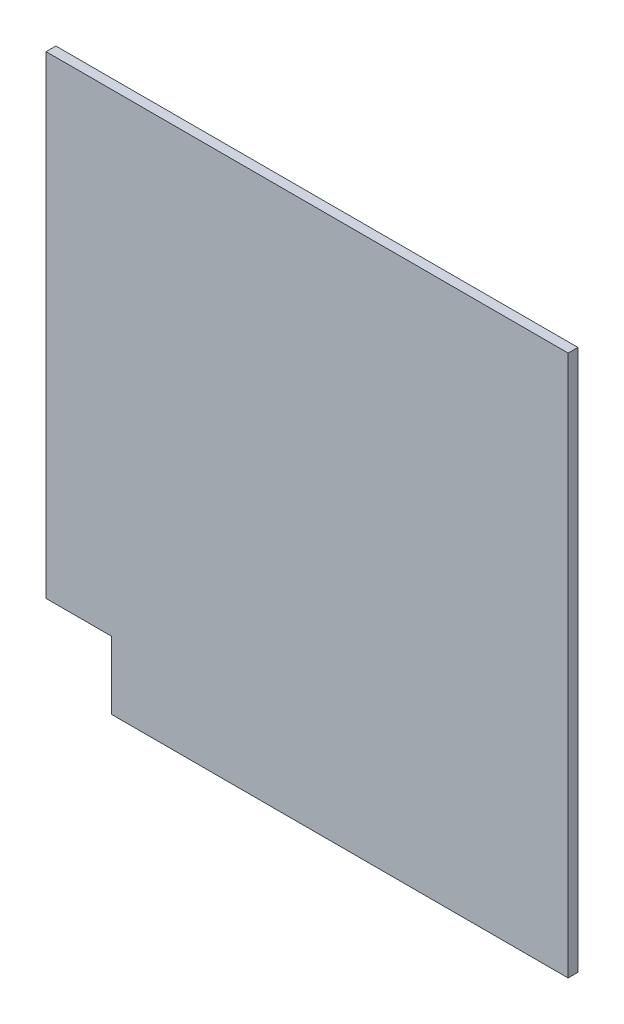
ISO-10303-21;
HEADER;
FILE_DESCRIPTION(('STEP AP214'),'2;1');
FILE_NAME('part.step','',(''),(''),'','','');
FILE_SCHEMA(('AUTOMOTIVE_DESIGN { 1 0 10303 214 1 1 1 1 }'));
ENDSEC;
DATA;
#1=APPLICATION_CONTEXT('core data for automotive mechanical design processes');
#2=APPLICATION_PROTOCOL_DEFINITION('international standard','automotive_design',2000,#1);
#3=PRODUCT_CONTEXT('',#1,'mechanical');
#4=PRODUCT('Part','Part','',(#3));
#5=PRODUCT_RELATED_PRODUCT_CATEGORY('part','',(#4));
#6=PRODUCT_DEFINITION_FORMATION('','',#4);
#7=PRODUCT_DEFINITION_CONTEXT('part definition',#1,'design');
#8=PRODUCT_DEFINITION('design','',#6,#7);
#9=PRODUCT_DEFINITION_SHAPE('','',#8);
#10=(LENGTH_UNIT() NAMED_UNIT(*) SI_UNIT(.MILLI.,.METRE.));
#11=(NAMED_UNIT(*) PLANE_ANGLE_UNIT() SI_UNIT($,.RADIAN.));
#12=(NAMED_UNIT(*) SI_UNIT($,.STERADIAN.) SOLID_ANGLE_UNIT());
#13=UNCERTAINTY_MEASURE_WITH_UNIT(LENGTH_MEASURE(1.E-05),#10,'distance_accuracy_value','');
#14=(GEOMETRIC_REPRESENTATION_CONTEXT(3) GLOBAL_UNCERTAINTY_ASSIGNED_CONTEXT((#13)) GLOBAL_UNIT_ASSIGNED_CONTEXT((#10,
#11,#12)) REPRESENTATION_CONTEXT('',''));
#15=CARTESIAN_POINT('',(0.,0.,0.));
#16=DIRECTION('',(0.,0.,1.));
#17=DIRECTION('',(1.,0.,0.));
#18=AXIS2_PLACEMENT_3D('',#15,#16,#17);
#19=CARTESIAN_POINT('',(40.,41.4692864329527,1.5));
#20=DIRECTION('',(-1.,0.,0.));
#21=DIRECTION('',(0.,-1.,0.));
#22=AXIS2_PLACEMENT_3D('',#19,#20,#21);
#23=PLANE('',#22);
#24=DIRECTION('',(0.,1.,0.));
#25=VECTOR('',#24,1.);
#26=CARTESIAN_POINT('',(40.,41.4692864329527,0.));
#27=LINE('',#26,#25);
#28=CARTESIAN_POINT('',(40.,-41.4692864329527,0.));
#29=VERTEX_POINT('',#28);
#30=CARTESIAN_POINT('',(40.,41.4692864329527,0.));
#31=VERTEX_POINT('',#30);
#32=EDGE_CURVE('E117',#29,#31,#27,.T.);
#33=ORIENTED_EDGE('',*,*,#32,.T.);
#34=DIRECTION('',(0.,0.,-1.));
#35=VECTOR('',#34,1.);
#36=CARTESIAN_POINT('',(40.,41.4692864329527,1.5));
#37=LINE('',#36,#35);
#38=CARTESIAN_POINT('',(40.,41.4692864329527,1.5));
#39=VERTEX_POINT('',#38);
#40=EDGE_CURVE('E11',#39,#31,#37,.T.);
#41=ORIENTED_EDGE('',*,*,#40,.F.);
#42=DIRECTION('',(0.,1.,0.));
#43=VECTOR('',#42,1.);
#44=CARTESIAN_POINT('',(40.,41.4692864329527,1.5));
#45=LINE('',#44,#43);
#46=CARTESIAN_POINT('',(40.,-41.4692864329527,1.5));
#47=VERTEX_POINT('',#46);
#48=EDGE_CURVE('E127',#47,#39,#45,.T.);
#49=ORIENTED_EDGE('',*,*,#48,.F.);
#50=DIRECTION('',(0.,0.,-1.));
#51=VECTOR('',#50,1.);
#52=CARTESIAN_POINT('',(40.,-41.4692864329527,1.5));
#53=LINE('',#52,#51);
#54=EDGE_CURVE('E113',#47,#29,#53,.T.);
#55=ORIENTED_EDGE('',*,*,#54,.T.);
#56=EDGE_LOOP('',(#33,#41,#49,#55));
#57=FACE_BOUND('',#56,.T.);
#58=ADVANCED_FACE('F33',(#57),#23,.F.);
#59=CARTESIAN_POINT('',(-40.,41.4692864329527,1.5));
#60=DIRECTION('',(0.,-1.,0.));
#61=DIRECTION('',(0.,0.,-1.));
#62=AXIS2_PLACEMENT_3D('',#59,#60,#61);
#63=PLANE('',#62);
#64=DIRECTION('',(-1.,0.,0.));
#65=VECTOR('',#64,1.);
#66=CARTESIAN_POINT('',(-40.,41.4692864329527,0.));
#67=LINE('',#66,#65);
#68=CARTESIAN_POINT('',(-40.,41.4692864329527,0.));
#69=VERTEX_POINT('',#68);
#70=EDGE_CURVE('E120',#31,#69,#67,.T.);
#71=ORIENTED_EDGE('',*,*,#70,.T.);
#72=DIRECTION('',(0.,0.,-1.));
#73=VECTOR('',#72,1.);
#74=CARTESIAN_POINT('',(-40.,41.4692864329527,1.5));
#75=LINE('',#74,#73);
#76=CARTESIAN_POINT('',(-40.,41.4692864329527,1.5));
#77=VERTEX_POINT('',#76);
#78=EDGE_CURVE('E41',#77,#69,#75,.T.);
#79=ORIENTED_EDGE('',*,*,#78,.F.);
#80=DIRECTION('',(-1.,0.,0.));
#81=VECTOR('',#80,1.);
#82=CARTESIAN_POINT('',(-40.,41.4692864329527,1.5));
#83=LINE('',#82,#81);
#84=EDGE_CURVE('E86',#39,#77,#83,.T.);
#85=ORIENTED_EDGE('',*,*,#84,.F.);
#86=ORIENTED_EDGE('',*,*,#40,.T.);
#87=EDGE_LOOP('',(#71,#79,#85,#86));
#88=FACE_BOUND('',#87,.T.);
#89=ADVANCED_FACE('F151',(#88),#63,.F.);
#90=CARTESIAN_POINT('',(-40.,41.4692864329527,1.5));
#91=DIRECTION('',(1.,0.,0.));
#92=DIRECTION('',(0.,0.,-1.));
#93=AXIS2_PLACEMENT_3D('',#90,#91,#92);
#94=PLANE('',#93);
#95=DIRECTION('',(0.,-1.,0.));
#96=VECTOR('',#95,1.);
#97=CARTESIAN_POINT('',(-40.,41.4692864329527,0.));
#98=LINE('',#97,#96);
#99=CARTESIAN_POINT('',(-40.,-31.1019648247145,0.));
#100=VERTEX_POINT('',#99);
#101=EDGE_CURVE('E122',#69,#100,#98,.T.);
#102=ORIENTED_EDGE('',*,*,#101,.T.);
#103=DIRECTION('',(0.,0.,-1.));
#104=VECTOR('',#103,1.);
#105=CARTESIAN_POINT('',(-40.,-31.1019648247145,1.5));
#106=LINE('',#105,#104);
#107=CARTESIAN_POINT('',(-40.,-31.1019648247145,1.5));
#108=VERTEX_POINT('',#107);
#109=EDGE_CURVE('E108',#108,#100,#106,.T.);
#110=ORIENTED_EDGE('',*,*,#109,.F.);
#111=DIRECTION('',(0.,-1.,0.));
#112=VECTOR('',#111,1.);
#113=CARTESIAN_POINT('',(-40.,41.4692864329527,1.5));
#114=LINE('',#113,#112);
#115=EDGE_CURVE('E99',#77,#108,#114,.T.);
#116=ORIENTED_EDGE('',*,*,#115,.F.);
#117=ORIENTED_EDGE('',*,*,#78,.T.);
#118=EDGE_LOOP('',(#102,#110,#116,#117));
#119=FACE_BOUND('',#118,.T.);
#120=ADVANCED_FACE('F133',(#119),#94,.F.);
#121=CARTESIAN_POINT('',(-40.,-31.1019648247145,1.5));
#122=DIRECTION('',(0.,1.,0.));
#123=DIRECTION('',(0.,0.,1.));
#124=AXIS2_PLACEMENT_3D('',#121,#122,#123);
#125=PLANE('',#124);
#126=DIRECTION('',(1.,0.,0.));
#127=VECTOR('',#126,1.);
#128=CARTESIAN_POINT('',(-40.,-31.1019648247145,0.));
#129=LINE('',#128,#127);
#130=CARTESIAN_POINT('',(-30.,-31.1019648247145,0.));
#131=VERTEX_POINT('',#130);
#132=EDGE_CURVE('E107',#100,#131,#129,.T.);
#133=ORIENTED_EDGE('',*,*,#132,.T.);
#134=DIRECTION('',(0.,0.,-1.));
#135=VECTOR('',#134,1.);
#136=CARTESIAN_POINT('',(-30.,-31.1019648247145,1.5));
#137=LINE('',#136,#135);
#138=CARTESIAN_POINT('',(-30.,-31.1019648247145,1.5));
#139=VERTEX_POINT('',#138);
#140=EDGE_CURVE('E104',#139,#131,#137,.T.);
#141=ORIENTED_EDGE('',*,*,#140,.F.);
#142=DIRECTION('',(1.,0.,0.));
#143=VECTOR('',#142,1.);
#144=CARTESIAN_POINT('',(-40.,-31.1019648247145,1.5));
#145=LINE('',#144,#143);
#146=EDGE_CURVE('E93',#108,#139,#145,.T.);
#147=ORIENTED_EDGE('',*,*,#146,.F.);
#148=ORIENTED_EDGE('',*,*,#109,.T.);
#149=EDGE_LOOP('',(#133,#141,#147,#148));
#150=FACE_BOUND('',#149,.T.);
#151=ADVANCED_FACE('F105',(#150),#125,.F.);
#152=CARTESIAN_POINT('',(-30.,-41.4692864329527,1.5));
#153=DIRECTION('',(1.,0.,0.));
#154=DIRECTION('',(0.,0.,-1.));
#155=AXIS2_PLACEMENT_3D('',#152,#153,#154);
#156=PLANE('',#155);
#157=DIRECTION('',(0.,-1.,0.));
#158=VECTOR('',#157,1.);
#159=CARTESIAN_POINT('',(-30.,-41.4692864329527,0.));
#160=LINE('',#159,#158);
#161=CARTESIAN_POINT('',(-30.,-41.4692864329527,0.));
#162=VERTEX_POINT('',#161);
#163=EDGE_CURVE('E72',#131,#162,#160,.T.);
#164=ORIENTED_EDGE('',*,*,#163,.T.);
#165=DIRECTION('',(0.,0.,-1.));
#166=VECTOR('',#165,1.);
#167=CARTESIAN_POINT('',(-30.,-41.4692864329527,1.5));
#168=LINE('',#167,#166);
#169=CARTESIAN_POINT('',(-30.,-41.4692864329527,1.5));
#170=VERTEX_POINT('',#169);
#171=EDGE_CURVE('E109',#170,#162,#168,.T.);
#172=ORIENTED_EDGE('',*,*,#171,.F.);
#173=DIRECTION('',(0.,-1.,0.));
#174=VECTOR('',#173,1.);
#175=CARTESIAN_POINT('',(-30.,-41.4692864329527,1.5));
#176=LINE('',#175,#174);
#177=EDGE_CURVE('E97',#139,#170,#176,.T.);
#178=ORIENTED_EDGE('',*,*,#177,.F.);
#179=ORIENTED_EDGE('',*,*,#140,.T.);
#180=EDGE_LOOP('',(#164,#172,#178,#179));
#181=FACE_BOUND('',#180,.T.);
#182=ADVANCED_FACE('F111',(#181),#156,.F.);
#183=CARTESIAN_POINT('',(-30.,-41.4692864329527,1.5));
#184=DIRECTION('',(0.,1.,0.));
#185=DIRECTION('',(0.,0.,1.));
#186=AXIS2_PLACEMENT_3D('',#183,#184,#185);
#187=PLANE('',#186);
#188=DIRECTION('',(1.,0.,0.));
#189=VECTOR('',#188,1.);
#190=CARTESIAN_POINT('',(-30.,-41.4692864329527,0.));
#191=LINE('',#190,#189);
#192=EDGE_CURVE('E78',#162,#29,#191,.T.);
#193=ORIENTED_EDGE('',*,*,#192,.T.);
#194=ORIENTED_EDGE('',*,*,#54,.F.);
#195=DIRECTION('',(1.,0.,0.));
#196=VECTOR('',#195,1.);
#197=CARTESIAN_POINT('',(-30.,-41.4692864329527,1.5));
#198=LINE('',#197,#196);
#199=EDGE_CURVE('E49',#170,#47,#198,.T.);
#200=ORIENTED_EDGE('',*,*,#199,.F.);
#201=ORIENTED_EDGE('',*,*,#171,.T.);
#202=EDGE_LOOP('',(#193,#194,#200,#201));
#203=FACE_BOUND('',#202,.T.);
#204=ADVANCED_FACE('F140',(#203),#187,.F.);
#205=CARTESIAN_POINT('',(0.,0.,1.5));
#206=DIRECTION('',(0.,0.,1.));
#207=DIRECTION('',(1.,0.,0.));
#208=AXIS2_PLACEMENT_3D('',#205,#206,#207);
#209=PLANE('',#208);
#210=ORIENTED_EDGE('',*,*,#48,.T.);
#211=ORIENTED_EDGE('',*,*,#84,.T.);
#212=ORIENTED_EDGE('',*,*,#115,.T.);
#213=ORIENTED_EDGE('',*,*,#146,.T.);
#214=ORIENTED_EDGE('',*,*,#177,.T.);
#215=ORIENTED_EDGE('',*,*,#199,.T.);
#216=EDGE_LOOP('',(#210,#211,#212,#213,#214,#215));
#217=FACE_BOUND('',#216,.T.);
#218=ADVANCED_FACE('F95',(#217),#209,.T.);
#219=CARTESIAN_POINT('',(0.,0.,0.));
#220=DIRECTION('',(0.,0.,1.));
#221=DIRECTION('',(1.,0.,0.));
#222=AXIS2_PLACEMENT_3D('',#219,#220,#221);
#223=PLANE('',#222);
#224=ORIENTED_EDGE('',*,*,#32,.F.);
#225=ORIENTED_EDGE('',*,*,#192,.F.);
#226=ORIENTED_EDGE('',*,*,#163,.F.);
#227=ORIENTED_EDGE('',*,*,#132,.F.);
#228=ORIENTED_EDGE('',*,*,#101,.F.);
#229=ORIENTED_EDGE('',*,*,#70,.F.);
#230=EDGE_LOOP('',(#224,#225,#226,#227,#228,#229));
#231=FACE_BOUND('',#230,.T.);
#232=ADVANCED_FACE('F136',(#231),#223,.F.);
#233=CLOSED_SHELL('',(#58,#89,#120,#151,#182,#204,#218,#232));
#234=MANIFOLD_SOLID_BREP('B2',#233);
#235=ADVANCED_BREP_SHAPE_REPRESENTATION('',(#18,#234),#14);
#236=SHAPE_DEFINITION_REPRESENTATION(#9,#235);
ENDSEC;
END-ISO-10303-21;
